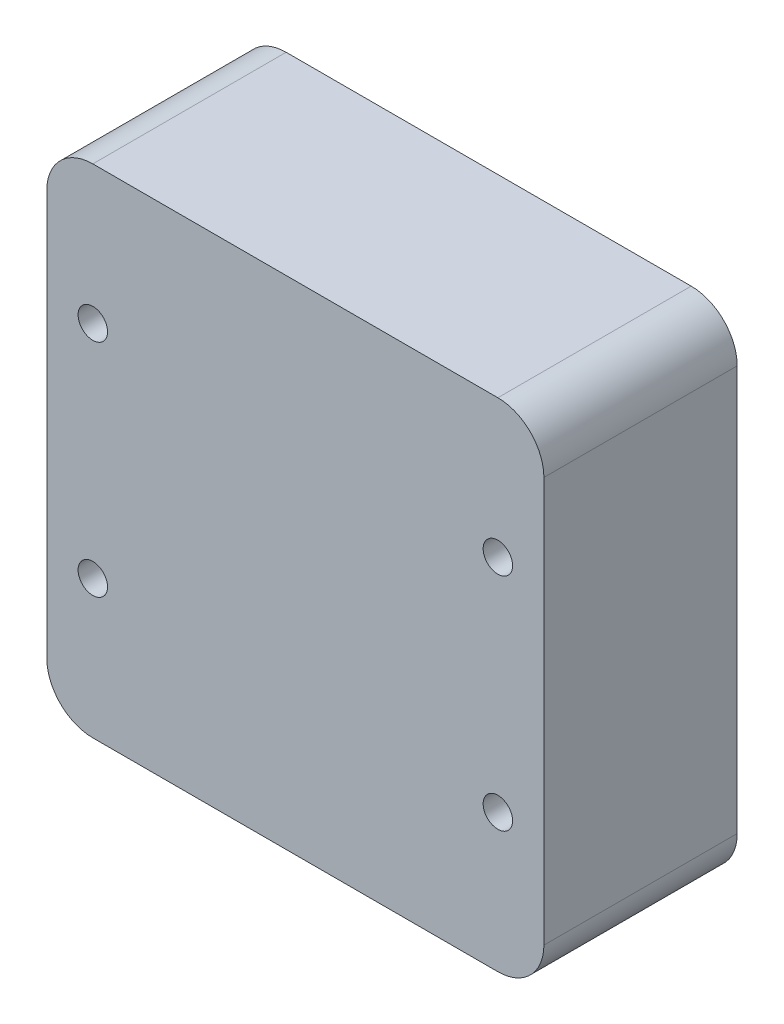
ISO-10303-21;
HEADER;
FILE_DESCRIPTION(('STEP AP214'),'2;1');
FILE_NAME('part.step','',(''),(''),'','','');
FILE_SCHEMA(('AUTOMOTIVE_DESIGN { 1 0 10303 214 1 1 1 1 }'));
ENDSEC;
DATA;
#1=APPLICATION_CONTEXT('core data for automotive mechanical design processes');
#2=APPLICATION_PROTOCOL_DEFINITION('international standard','automotive_design',2000,#1);
#3=PRODUCT_CONTEXT('',#1,'mechanical');
#4=PRODUCT('Part','Part','',(#3));
#5=PRODUCT_RELATED_PRODUCT_CATEGORY('part','',(#4));
#6=PRODUCT_DEFINITION_FORMATION('','',#4);
#7=PRODUCT_DEFINITION_CONTEXT('part definition',#1,'design');
#8=PRODUCT_DEFINITION('design','',#6,#7);
#9=PRODUCT_DEFINITION_SHAPE('','',#8);
#10=(LENGTH_UNIT() NAMED_UNIT(*) SI_UNIT(.MILLI.,.METRE.));
#11=(NAMED_UNIT(*) PLANE_ANGLE_UNIT() SI_UNIT($,.RADIAN.));
#12=(NAMED_UNIT(*) SI_UNIT($,.STERADIAN.) SOLID_ANGLE_UNIT());
#13=UNCERTAINTY_MEASURE_WITH_UNIT(LENGTH_MEASURE(1.E-05),#10,'distance_accuracy_value','');
#14=(GEOMETRIC_REPRESENTATION_CONTEXT(3) GLOBAL_UNCERTAINTY_ASSIGNED_CONTEXT((#13)) GLOBAL_UNIT_ASSIGNED_CONTEXT((#10,
#11,#12)) REPRESENTATION_CONTEXT('',''));
#15=CARTESIAN_POINT('',(0.,0.,0.));
#16=DIRECTION('',(0.,0.,1.));
#17=DIRECTION('',(1.,0.,0.));
#18=AXIS2_PLACEMENT_3D('',#15,#16,#17);
#19=CARTESIAN_POINT('',(-24.4173913043478,16.0434782608696,21.));
#20=DIRECTION('',(1.,0.,0.));
#21=DIRECTION('',(0.,1.,0.));
#22=AXIS2_PLACEMENT_3D('',#19,#20,#21);
#23=PLANE('',#22);
#24=DIRECTION('',(0.,-1.,0.));
#25=VECTOR('',#24,1.);
#26=CARTESIAN_POINT('',(-24.4173913043478,16.0434782608696,21.));
#27=LINE('',#26,#25);
#28=CARTESIAN_POINT('',(-24.4173913043478,11.0434782608696,21.));
#29=VERTEX_POINT('',#28);
#30=CARTESIAN_POINT('',(-24.4173913043478,-32.9565217391304,21.));
#31=VERTEX_POINT('',#30);
#32=EDGE_CURVE('E120',#29,#31,#27,.T.);
#33=ORIENTED_EDGE('',*,*,#32,.F.);
#34=DIRECTION('',(0.,0.,-1.));
#35=VECTOR('',#34,1.);
#36=CARTESIAN_POINT('',(-24.4173913043478,11.0434782608696,21.));
#37=LINE('',#36,#35);
#38=CARTESIAN_POINT('',(-24.4173913043478,11.0434782608696,0.));
#39=VERTEX_POINT('',#38);
#40=EDGE_CURVE('E105',#29,#39,#37,.T.);
#41=ORIENTED_EDGE('',*,*,#40,.T.);
#42=DIRECTION('',(0.,-1.,0.));
#43=VECTOR('',#42,1.);
#44=CARTESIAN_POINT('',(-24.4173913043478,16.0434782608696,0.));
#45=LINE('',#44,#43);
#46=CARTESIAN_POINT('',(-24.4173913043478,-32.9565217391304,0.));
#47=VERTEX_POINT('',#46);
#48=EDGE_CURVE('E117',#39,#47,#45,.T.);
#49=ORIENTED_EDGE('',*,*,#48,.T.);
#50=DIRECTION('',(0.,0.,-1.));
#51=VECTOR('',#50,1.);
#52=CARTESIAN_POINT('',(-24.4173913043478,-32.9565217391304,21.));
#53=LINE('',#52,#51);
#54=EDGE_CURVE('E122',#47,#31,#53,.F.);
#55=ORIENTED_EDGE('',*,*,#54,.T.);
#56=EDGE_LOOP('',(#33,#41,#49,#55));
#57=FACE_BOUND('',#56,.T.);
#58=ADVANCED_FACE('F35',(#57),#23,.F.);
#59=CARTESIAN_POINT('',(-24.4173913043478,-37.9565217391304,21.));
#60=DIRECTION('',(0.,1.,0.));
#61=DIRECTION('',(0.,0.,1.));
#62=AXIS2_PLACEMENT_3D('',#59,#60,#61);
#63=PLANE('',#62);
#64=DIRECTION('',(1.,0.,0.));
#65=VECTOR('',#64,1.);
#66=CARTESIAN_POINT('',(-24.4173913043478,-37.9565217391304,21.));
#67=LINE('',#66,#65);
#68=CARTESIAN_POINT('',(-19.4173913043478,-37.9565217391304,21.));
#69=VERTEX_POINT('',#68);
#70=CARTESIAN_POINT('',(24.5826086956522,-37.9565217391304,21.));
#71=VERTEX_POINT('',#70);
#72=EDGE_CURVE('E166',#69,#71,#67,.T.);
#73=ORIENTED_EDGE('',*,*,#72,.F.);
#74=DIRECTION('',(0.,0.,-1.));
#75=VECTOR('',#74,1.);
#76=CARTESIAN_POINT('',(-19.4173913043478,-37.9565217391304,21.));
#77=LINE('',#76,#75);
#78=CARTESIAN_POINT('',(-19.4173913043478,-37.9565217391304,0.));
#79=VERTEX_POINT('',#78);
#80=EDGE_CURVE('E159',#69,#79,#77,.T.);
#81=ORIENTED_EDGE('',*,*,#80,.T.);
#82=DIRECTION('',(1.,0.,0.));
#83=VECTOR('',#82,1.);
#84=CARTESIAN_POINT('',(-24.4173913043478,-37.9565217391304,0.));
#85=LINE('',#84,#83);
#86=CARTESIAN_POINT('',(24.5826086956522,-37.9565217391304,0.));
#87=VERTEX_POINT('',#86);
#88=EDGE_CURVE('E126',#79,#87,#85,.T.);
#89=ORIENTED_EDGE('',*,*,#88,.T.);
#90=DIRECTION('',(0.,0.,-1.));
#91=VECTOR('',#90,1.);
#92=CARTESIAN_POINT('',(24.5826086956522,-37.9565217391304,21.));
#93=LINE('',#92,#91);
#94=EDGE_CURVE('E157',#87,#71,#93,.F.);
#95=ORIENTED_EDGE('',*,*,#94,.T.);
#96=EDGE_LOOP('',(#73,#81,#89,#95));
#97=FACE_BOUND('',#96,.T.);
#98=ADVANCED_FACE('F164',(#97),#63,.F.);
#99=CARTESIAN_POINT('',(29.5826086956522,16.0434782608696,21.));
#100=DIRECTION('',(-1.,0.,0.));
#101=DIRECTION('',(0.,0.,1.));
#102=AXIS2_PLACEMENT_3D('',#99,#100,#101);
#103=PLANE('',#102);
#104=DIRECTION('',(0.,1.,0.));
#105=VECTOR('',#104,1.);
#106=CARTESIAN_POINT('',(29.5826086956522,16.0434782608696,21.));
#107=LINE('',#106,#105);
#108=CARTESIAN_POINT('',(29.5826086956522,-32.9565217391304,21.));
#109=VERTEX_POINT('',#108);
#110=CARTESIAN_POINT('',(29.5826086956522,11.0434782608696,21.));
#111=VERTEX_POINT('',#110);
#112=EDGE_CURVE('E174',#109,#111,#107,.T.);
#113=ORIENTED_EDGE('',*,*,#112,.F.);
#114=DIRECTION('',(0.,0.,-1.));
#115=VECTOR('',#114,1.);
#116=CARTESIAN_POINT('',(29.5826086956522,-32.9565217391304,21.));
#117=LINE('',#116,#115);
#118=CARTESIAN_POINT('',(29.5826086956522,-32.9565217391304,0.));
#119=VERTEX_POINT('',#118);
#120=EDGE_CURVE('E11',#109,#119,#117,.T.);
#121=ORIENTED_EDGE('',*,*,#120,.T.);
#122=DIRECTION('',(0.,1.,0.));
#123=VECTOR('',#122,1.);
#124=CARTESIAN_POINT('',(29.5826086956522,16.0434782608696,0.));
#125=LINE('',#124,#123);
#126=CARTESIAN_POINT('',(29.5826086956522,11.0434782608696,0.));
#127=VERTEX_POINT('',#126);
#128=EDGE_CURVE('E130',#119,#127,#125,.T.);
#129=ORIENTED_EDGE('',*,*,#128,.T.);
#130=DIRECTION('',(0.,0.,-1.));
#131=VECTOR('',#130,1.);
#132=CARTESIAN_POINT('',(29.5826086956522,11.0434782608696,21.));
#133=LINE('',#132,#131);
#134=EDGE_CURVE('E43',#127,#111,#133,.F.);
#135=ORIENTED_EDGE('',*,*,#134,.T.);
#136=EDGE_LOOP('',(#113,#121,#129,#135));
#137=FACE_BOUND('',#136,.T.);
#138=ADVANCED_FACE('F173',(#137),#103,.F.);
#139=CARTESIAN_POINT('',(-24.4173913043478,16.0434782608696,21.));
#140=DIRECTION('',(0.,-1.,0.));
#141=DIRECTION('',(0.,0.,-1.));
#142=AXIS2_PLACEMENT_3D('',#139,#140,#141);
#143=PLANE('',#142);
#144=DIRECTION('',(-1.,0.,0.));
#145=VECTOR('',#144,1.);
#146=CARTESIAN_POINT('',(-24.4173913043478,16.0434782608696,0.));
#147=LINE('',#146,#145);
#148=CARTESIAN_POINT('',(24.5826086956522,16.0434782608696,0.));
#149=VERTEX_POINT('',#148);
#150=CARTESIAN_POINT('',(-19.4173913043478,16.0434782608696,0.));
#151=VERTEX_POINT('',#150);
#152=EDGE_CURVE('E140',#149,#151,#147,.T.);
#153=ORIENTED_EDGE('',*,*,#152,.T.);
#154=DIRECTION('',(0.,0.,-1.));
#155=VECTOR('',#154,1.);
#156=CARTESIAN_POINT('',(-19.4173913043478,16.0434782608696,21.));
#157=LINE('',#156,#155);
#158=CARTESIAN_POINT('',(-19.4173913043478,16.0434782608696,21.));
#159=VERTEX_POINT('',#158);
#160=EDGE_CURVE('E106',#151,#159,#157,.F.);
#161=ORIENTED_EDGE('',*,*,#160,.T.);
#162=DIRECTION('',(-1.,0.,0.));
#163=VECTOR('',#162,1.);
#164=CARTESIAN_POINT('',(-24.4173913043478,16.0434782608696,21.));
#165=LINE('',#164,#163);
#166=CARTESIAN_POINT('',(24.5826086956522,16.0434782608696,21.));
#167=VERTEX_POINT('',#166);
#168=EDGE_CURVE('E136',#167,#159,#165,.T.);
#169=ORIENTED_EDGE('',*,*,#168,.F.);
#170=DIRECTION('',(0.,0.,-1.));
#171=VECTOR('',#170,1.);
#172=CARTESIAN_POINT('',(24.5826086956522,16.0434782608696,21.));
#173=LINE('',#172,#171);
#174=EDGE_CURVE('E111',#167,#149,#173,.T.);
#175=ORIENTED_EDGE('',*,*,#174,.T.);
#176=EDGE_LOOP('',(#153,#161,#169,#175));
#177=FACE_BOUND('',#176,.T.);
#178=ADVANCED_FACE('F213',(#177),#143,.F.);
#179=CARTESIAN_POINT('',(0.,0.,21.));
#180=DIRECTION('',(0.,0.,1.));
#181=DIRECTION('',(1.,0.,0.));
#182=AXIS2_PLACEMENT_3D('',#179,#180,#181);
#183=PLANE('',#182);
#184=CARTESIAN_POINT('',(-19.4173913043478,-22.9565217391304,21.));
#185=DIRECTION('',(0.,0.,1.));
#186=DIRECTION('',(1.,0.,0.));
#187=AXIS2_PLACEMENT_3D('',#184,#185,#186);
#188=CIRCLE('',#187,1.6);
#189=CARTESIAN_POINT('',(-17.8173913043478,-22.9565217391304,21.));
#190=VERTEX_POINT('',#189);
#191=EDGE_CURVE('E195',#190,#190,#188,.T.);
#192=ORIENTED_EDGE('',*,*,#191,.F.);
#193=EDGE_LOOP('',(#192));
#194=FACE_BOUND('',#193,.T.);
#195=CARTESIAN_POINT('',(-19.4173913043478,1.04347826086956,21.));
#196=DIRECTION('',(0.,0.,1.));
#197=DIRECTION('',(1.,0.,0.));
#198=AXIS2_PLACEMENT_3D('',#195,#196,#197);
#199=CIRCLE('',#198,1.6);
#200=CARTESIAN_POINT('',(-17.8173913043478,1.04347826086956,21.));
#201=VERTEX_POINT('',#200);
#202=EDGE_CURVE('E189',#201,#201,#199,.T.);
#203=ORIENTED_EDGE('',*,*,#202,.F.);
#204=EDGE_LOOP('',(#203));
#205=FACE_BOUND('',#204,.T.);
#206=CARTESIAN_POINT('',(24.5826086956522,1.04347826086956,21.));
#207=DIRECTION('',(0.,0.,1.));
#208=DIRECTION('',(1.,0.,0.));
#209=AXIS2_PLACEMENT_3D('',#206,#207,#208);
#210=CIRCLE('',#209,1.6);
#211=CARTESIAN_POINT('',(26.1826086956522,1.04347826086956,21.));
#212=VERTEX_POINT('',#211);
#213=EDGE_CURVE('E183',#212,#212,#210,.T.);
#214=ORIENTED_EDGE('',*,*,#213,.F.);
#215=EDGE_LOOP('',(#214));
#216=FACE_BOUND('',#215,.T.);
#217=CARTESIAN_POINT('',(24.5826086956522,-22.9565217391304,21.));
#218=DIRECTION('',(0.,0.,1.));
#219=DIRECTION('',(1.,0.,0.));
#220=AXIS2_PLACEMENT_3D('',#217,#218,#219);
#221=CIRCLE('',#220,1.6);
#222=CARTESIAN_POINT('',(26.1826086956522,-22.9565217391304,21.));
#223=VERTEX_POINT('',#222);
#224=EDGE_CURVE('E133',#223,#223,#221,.T.);
#225=ORIENTED_EDGE('',*,*,#224,.F.);
#226=EDGE_LOOP('',(#225));
#227=FACE_BOUND('',#226,.T.);
#228=ORIENTED_EDGE('',*,*,#168,.T.);
#229=CARTESIAN_POINT('',(-19.4173913043478,11.0434782608696,21.));
#230=DIRECTION('',(0.,0.,1.));
#231=DIRECTION('',(1.,0.,0.));
#232=AXIS2_PLACEMENT_3D('',#229,#230,#231);
#233=CIRCLE('',#232,5.);
#234=EDGE_CURVE('E155',#159,#29,#233,.T.);
#235=ORIENTED_EDGE('',*,*,#234,.T.);
#236=ORIENTED_EDGE('',*,*,#32,.T.);
#237=CARTESIAN_POINT('',(-19.4173913043478,-32.9565217391304,21.));
#238=DIRECTION('',(0.,0.,1.));
#239=DIRECTION('',(1.,0.,0.));
#240=AXIS2_PLACEMENT_3D('',#237,#238,#239);
#241=CIRCLE('',#240,5.);
#242=EDGE_CURVE('E153',#31,#69,#241,.T.);
#243=ORIENTED_EDGE('',*,*,#242,.T.);
#244=ORIENTED_EDGE('',*,*,#72,.T.);
#245=CARTESIAN_POINT('',(24.5826086956522,-32.9565217391304,21.));
#246=DIRECTION('',(0.,0.,1.));
#247=DIRECTION('',(1.,0.,0.));
#248=AXIS2_PLACEMENT_3D('',#245,#246,#247);
#249=CIRCLE('',#248,5.);
#250=EDGE_CURVE('E56',#71,#109,#249,.T.);
#251=ORIENTED_EDGE('',*,*,#250,.T.);
#252=ORIENTED_EDGE('',*,*,#112,.T.);
#253=CARTESIAN_POINT('',(24.5826086956522,11.0434782608696,21.));
#254=DIRECTION('',(0.,0.,1.));
#255=DIRECTION('',(1.,0.,0.));
#256=AXIS2_PLACEMENT_3D('',#253,#254,#255);
#257=CIRCLE('',#256,5.);
#258=EDGE_CURVE('E150',#111,#167,#257,.T.);
#259=ORIENTED_EDGE('',*,*,#258,.T.);
#260=EDGE_LOOP('',(#228,#235,#236,#243,#244,#251,#252,#259));
#261=FACE_BOUND('',#260,.T.);
#262=ADVANCED_FACE('F210',(#194,#205,#216,#227,#261),#183,.T.);
#263=CARTESIAN_POINT('',(0.,0.,0.));
#264=DIRECTION('',(0.,0.,1.));
#265=DIRECTION('',(1.,0.,0.));
#266=AXIS2_PLACEMENT_3D('',#263,#264,#265);
#267=PLANE('',#266);
#268=ORIENTED_EDGE('',*,*,#48,.F.);
#269=CARTESIAN_POINT('',(-19.4173913043478,11.0434782608696,0.));
#270=DIRECTION('',(0.,0.,1.));
#271=DIRECTION('',(1.,0.,0.));
#272=AXIS2_PLACEMENT_3D('',#269,#270,#271);
#273=CIRCLE('',#272,5.);
#274=EDGE_CURVE('E101',#39,#151,#273,.F.);
#275=ORIENTED_EDGE('',*,*,#274,.T.);
#276=ORIENTED_EDGE('',*,*,#152,.F.);
#277=CARTESIAN_POINT('',(24.5826086956522,11.0434782608696,0.));
#278=DIRECTION('',(0.,0.,1.));
#279=DIRECTION('',(1.,0.,0.));
#280=AXIS2_PLACEMENT_3D('',#277,#278,#279);
#281=CIRCLE('',#280,5.);
#282=EDGE_CURVE('E121',#149,#127,#281,.F.);
#283=ORIENTED_EDGE('',*,*,#282,.T.);
#284=ORIENTED_EDGE('',*,*,#128,.F.);
#285=CARTESIAN_POINT('',(24.5826086956522,-32.9565217391304,0.));
#286=DIRECTION('',(0.,0.,1.));
#287=DIRECTION('',(1.,0.,0.));
#288=AXIS2_PLACEMENT_3D('',#285,#286,#287);
#289=CIRCLE('',#288,5.);
#290=EDGE_CURVE('E144',#119,#87,#289,.F.);
#291=ORIENTED_EDGE('',*,*,#290,.T.);
#292=ORIENTED_EDGE('',*,*,#88,.F.);
#293=CARTESIAN_POINT('',(-19.4173913043478,-32.9565217391304,0.));
#294=DIRECTION('',(0.,0.,1.));
#295=DIRECTION('',(1.,0.,0.));
#296=AXIS2_PLACEMENT_3D('',#293,#294,#295);
#297=CIRCLE('',#296,5.);
#298=EDGE_CURVE('E112',#79,#47,#297,.F.);
#299=ORIENTED_EDGE('',*,*,#298,.T.);
#300=EDGE_LOOP('',(#268,#275,#276,#283,#284,#291,#292,#299));
#301=FACE_BOUND('',#300,.T.);
#302=ADVANCED_FACE('F124',(#301),#267,.F.);
#303=CARTESIAN_POINT('',(-19.4173913043478,11.0434782608696,21.));
#304=DIRECTION('',(0.,0.,-1.));
#305=DIRECTION('',(-1.,0.,0.));
#306=AXIS2_PLACEMENT_3D('',#303,#304,#305);
#307=CYLINDRICAL_SURFACE('',#306,5.);
#308=ORIENTED_EDGE('',*,*,#234,.F.);
#309=ORIENTED_EDGE('',*,*,#160,.F.);
#310=ORIENTED_EDGE('',*,*,#274,.F.);
#311=ORIENTED_EDGE('',*,*,#40,.F.);
#312=EDGE_LOOP('',(#308,#309,#310,#311));
#313=FACE_BOUND('',#312,.T.);
#314=ADVANCED_FACE('F104',(#313),#307,.T.);
#315=CARTESIAN_POINT('',(-19.4173913043478,-32.9565217391304,21.));
#316=DIRECTION('',(0.,0.,-1.));
#317=DIRECTION('',(-1.,0.,0.));
#318=AXIS2_PLACEMENT_3D('',#315,#316,#317);
#319=CYLINDRICAL_SURFACE('',#318,5.);
#320=ORIENTED_EDGE('',*,*,#242,.F.);
#321=ORIENTED_EDGE('',*,*,#54,.F.);
#322=ORIENTED_EDGE('',*,*,#298,.F.);
#323=ORIENTED_EDGE('',*,*,#80,.F.);
#324=EDGE_LOOP('',(#320,#321,#322,#323));
#325=FACE_BOUND('',#324,.T.);
#326=ADVANCED_FACE('F233',(#325),#319,.T.);
#327=CARTESIAN_POINT('',(24.5826086956522,-32.9565217391304,21.));
#328=DIRECTION('',(0.,0.,-1.));
#329=DIRECTION('',(-1.,0.,0.));
#330=AXIS2_PLACEMENT_3D('',#327,#328,#329);
#331=CYLINDRICAL_SURFACE('',#330,5.);
#332=ORIENTED_EDGE('',*,*,#250,.F.);
#333=ORIENTED_EDGE('',*,*,#94,.F.);
#334=ORIENTED_EDGE('',*,*,#290,.F.);
#335=ORIENTED_EDGE('',*,*,#120,.F.);
#336=EDGE_LOOP('',(#332,#333,#334,#335));
#337=FACE_BOUND('',#336,.T.);
#338=ADVANCED_FACE('F172',(#337),#331,.T.);
#339=CARTESIAN_POINT('',(24.5826086956522,11.0434782608696,21.));
#340=DIRECTION('',(0.,0.,-1.));
#341=DIRECTION('',(-1.,0.,0.));
#342=AXIS2_PLACEMENT_3D('',#339,#340,#341);
#343=CYLINDRICAL_SURFACE('',#342,5.);
#344=ORIENTED_EDGE('',*,*,#258,.F.);
#345=ORIENTED_EDGE('',*,*,#134,.F.);
#346=ORIENTED_EDGE('',*,*,#282,.F.);
#347=ORIENTED_EDGE('',*,*,#174,.F.);
#348=EDGE_LOOP('',(#344,#345,#346,#347));
#349=FACE_BOUND('',#348,.T.);
#350=ADVANCED_FACE('F37',(#349),#343,.T.);
#351=CARTESIAN_POINT('',(24.5826086956522,-22.9565217391304,11.));
#352=DIRECTION('',(0.,0.,1.));
#353=DIRECTION('',(1.,0.,0.));
#354=AXIS2_PLACEMENT_3D('',#351,#352,#353);
#355=CYLINDRICAL_SURFACE('',#354,1.6);
#356=CARTESIAN_POINT('',(24.5826086956522,-22.9565217391304,11.));
#357=DIRECTION('',(0.,0.,1.));
#358=DIRECTION('',(1.,0.,0.));
#359=AXIS2_PLACEMENT_3D('',#356,#357,#358);
#360=CIRCLE('',#359,1.6);
#361=CARTESIAN_POINT('',(26.1826086956522,-22.9565217391304,11.));
#362=VERTEX_POINT('',#361);
#363=EDGE_CURVE('E127',#362,#362,#360,.T.);
#364=ORIENTED_EDGE('',*,*,#363,.F.);
#365=EDGE_LOOP('',(#364));
#366=FACE_BOUND('',#365,.T.);
#367=ORIENTED_EDGE('',*,*,#224,.T.);
#368=EDGE_LOOP('',(#367));
#369=FACE_BOUND('',#368,.T.);
#370=ADVANCED_FACE('F225',(#366,#369),#355,.F.);
#371=CARTESIAN_POINT('',(24.5826086956522,-22.9565217391304,11.));
#372=DIRECTION('',(0.,0.,1.));
#373=DIRECTION('',(1.,0.,0.));
#374=AXIS2_PLACEMENT_3D('',#371,#372,#373);
#375=PLANE('',#374);
#376=ORIENTED_EDGE('',*,*,#363,.T.);
#377=EDGE_LOOP('',(#376));
#378=FACE_BOUND('',#377,.T.);
#379=ADVANCED_FACE('F230',(#378),#375,.T.);
#380=CARTESIAN_POINT('',(24.5826086956522,1.04347826086956,11.));
#381=DIRECTION('',(0.,0.,1.));
#382=DIRECTION('',(1.,0.,0.));
#383=AXIS2_PLACEMENT_3D('',#380,#381,#382);
#384=CYLINDRICAL_SURFACE('',#383,1.6);
#385=CARTESIAN_POINT('',(24.5826086956522,1.04347826086956,11.));
#386=DIRECTION('',(0.,0.,1.));
#387=DIRECTION('',(1.,0.,0.));
#388=AXIS2_PLACEMENT_3D('',#385,#386,#387);
#389=CIRCLE('',#388,1.6);
#390=CARTESIAN_POINT('',(26.1826086956522,1.04347826086956,11.));
#391=VERTEX_POINT('',#390);
#392=EDGE_CURVE('E186',#391,#391,#389,.T.);
#393=ORIENTED_EDGE('',*,*,#392,.F.);
#394=EDGE_LOOP('',(#393));
#395=FACE_BOUND('',#394,.T.);
#396=ORIENTED_EDGE('',*,*,#213,.T.);
#397=EDGE_LOOP('',(#396));
#398=FACE_BOUND('',#397,.T.);
#399=ADVANCED_FACE('F278',(#395,#398),#384,.F.);
#400=CARTESIAN_POINT('',(24.5826086956522,1.04347826086956,11.));
#401=DIRECTION('',(0.,0.,1.));
#402=DIRECTION('',(1.,0.,0.));
#403=AXIS2_PLACEMENT_3D('',#400,#401,#402);
#404=PLANE('',#403);
#405=ORIENTED_EDGE('',*,*,#392,.T.);
#406=EDGE_LOOP('',(#405));
#407=FACE_BOUND('',#406,.T.);
#408=ADVANCED_FACE('F288',(#407),#404,.T.);
#409=CARTESIAN_POINT('',(-19.4173913043478,1.04347826086956,11.));
#410=DIRECTION('',(0.,0.,1.));
#411=DIRECTION('',(1.,0.,0.));
#412=AXIS2_PLACEMENT_3D('',#409,#410,#411);
#413=CYLINDRICAL_SURFACE('',#412,1.6);
#414=CARTESIAN_POINT('',(-19.4173913043478,1.04347826086956,11.));
#415=DIRECTION('',(0.,0.,1.));
#416=DIRECTION('',(1.,0.,0.));
#417=AXIS2_PLACEMENT_3D('',#414,#415,#416);
#418=CIRCLE('',#417,1.6);
#419=CARTESIAN_POINT('',(-17.8173913043478,1.04347826086956,11.));
#420=VERTEX_POINT('',#419);
#421=EDGE_CURVE('E192',#420,#420,#418,.T.);
#422=ORIENTED_EDGE('',*,*,#421,.F.);
#423=EDGE_LOOP('',(#422));
#424=FACE_BOUND('',#423,.T.);
#425=ORIENTED_EDGE('',*,*,#202,.T.);
#426=EDGE_LOOP('',(#425));
#427=FACE_BOUND('',#426,.T.);
#428=ADVANCED_FACE('F298',(#424,#427),#413,.F.);
#429=CARTESIAN_POINT('',(-19.4173913043478,1.04347826086956,11.));
#430=DIRECTION('',(0.,0.,1.));
#431=DIRECTION('',(1.,0.,0.));
#432=AXIS2_PLACEMENT_3D('',#429,#430,#431);
#433=PLANE('',#432);
#434=ORIENTED_EDGE('',*,*,#421,.T.);
#435=EDGE_LOOP('',(#434));
#436=FACE_BOUND('',#435,.T.);
#437=ADVANCED_FACE('F206',(#436),#433,.T.);
#438=CARTESIAN_POINT('',(-19.4173913043478,-22.9565217391304,11.));
#439=DIRECTION('',(0.,0.,1.));
#440=DIRECTION('',(1.,0.,0.));
#441=AXIS2_PLACEMENT_3D('',#438,#439,#440);
#442=CYLINDRICAL_SURFACE('',#441,1.6);
#443=CARTESIAN_POINT('',(-19.4173913043478,-22.9565217391304,11.));
#444=DIRECTION('',(0.,0.,1.));
#445=DIRECTION('',(1.,0.,0.));
#446=AXIS2_PLACEMENT_3D('',#443,#444,#445);
#447=CIRCLE('',#446,1.6);
#448=CARTESIAN_POINT('',(-17.8173913043478,-22.9565217391304,11.));
#449=VERTEX_POINT('',#448);
#450=EDGE_CURVE('E181',#449,#449,#447,.T.);
#451=ORIENTED_EDGE('',*,*,#450,.F.);
#452=EDGE_LOOP('',(#451));
#453=FACE_BOUND('',#452,.T.);
#454=ORIENTED_EDGE('',*,*,#191,.T.);
#455=EDGE_LOOP('',(#454));
#456=FACE_BOUND('',#455,.T.);
#457=ADVANCED_FACE('F203',(#453,#456),#442,.F.);
#458=CARTESIAN_POINT('',(-19.4173913043478,-22.9565217391304,11.));
#459=DIRECTION('',(0.,0.,1.));
#460=DIRECTION('',(1.,0.,0.));
#461=AXIS2_PLACEMENT_3D('',#458,#459,#460);
#462=PLANE('',#461);
#463=ORIENTED_EDGE('',*,*,#450,.T.);
#464=EDGE_LOOP('',(#463));
#465=FACE_BOUND('',#464,.T.);
#466=ADVANCED_FACE('F201',(#465),#462,.T.);
#467=CLOSED_SHELL('',(#58,#98,#138,#178,#262,#302,#314,#326,#338,#350,#370,#379,#399,#408,#428,
#437,#457,#466));
#468=MANIFOLD_SOLID_BREP('B2',#467);
#469=ADVANCED_BREP_SHAPE_REPRESENTATION('',(#18,#468),#14);
#470=SHAPE_DEFINITION_REPRESENTATION(#9,#469);
ENDSEC;
END-ISO-10303-21;
